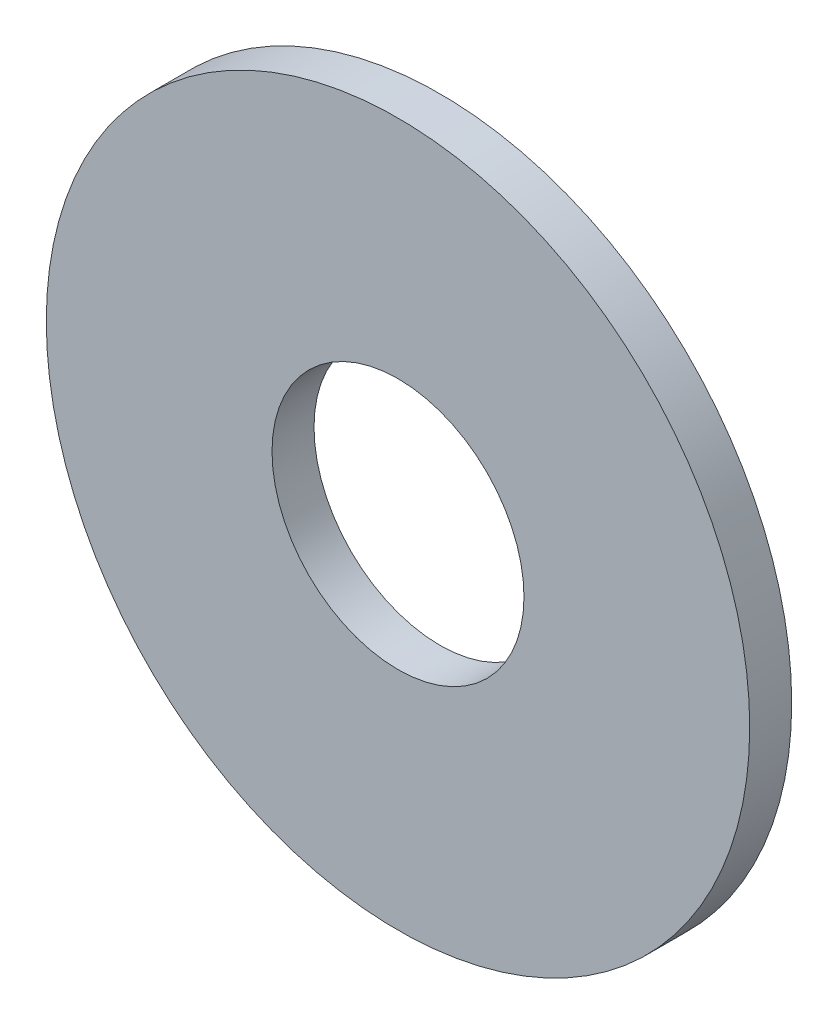
ISO-10303-21;
HEADER;
FILE_DESCRIPTION(('STEP AP214'),'2;1');
FILE_NAME('part.step','',(''),(''),'','','');
FILE_SCHEMA(('AUTOMOTIVE_DESIGN { 1 0 10303 214 1 1 1 1 }'));
ENDSEC;
DATA;
#1=APPLICATION_CONTEXT('core data for automotive mechanical design processes');
#2=APPLICATION_PROTOCOL_DEFINITION('international standard','automotive_design',2000,#1);
#3=PRODUCT_CONTEXT('',#1,'mechanical');
#4=PRODUCT('Part','Part','',(#3));
#5=PRODUCT_RELATED_PRODUCT_CATEGORY('part','',(#4));
#6=PRODUCT_DEFINITION_FORMATION('','',#4);
#7=PRODUCT_DEFINITION_CONTEXT('part definition',#1,'design');
#8=PRODUCT_DEFINITION('design','',#6,#7);
#9=PRODUCT_DEFINITION_SHAPE('','',#8);
#10=(LENGTH_UNIT() NAMED_UNIT(*) SI_UNIT(.MILLI.,.METRE.));
#11=(NAMED_UNIT(*) PLANE_ANGLE_UNIT() SI_UNIT($,.RADIAN.));
#12=(NAMED_UNIT(*) SI_UNIT($,.STERADIAN.) SOLID_ANGLE_UNIT());
#13=UNCERTAINTY_MEASURE_WITH_UNIT(LENGTH_MEASURE(1.E-05),#10,'distance_accuracy_value','');
#14=(GEOMETRIC_REPRESENTATION_CONTEXT(3) GLOBAL_UNCERTAINTY_ASSIGNED_CONTEXT((#13)) GLOBAL_UNIT_ASSIGNED_CONTEXT((#10,
#11,#12)) REPRESENTATION_CONTEXT('',''));
#15=CARTESIAN_POINT('',(0.,0.,0.));
#16=DIRECTION('',(0.,0.,1.));
#17=DIRECTION('',(1.,0.,0.));
#18=AXIS2_PLACEMENT_3D('',#15,#16,#17);
#19=CARTESIAN_POINT('',(0.,0.,2.));
#20=DIRECTION('',(0.,0.,1.));
#21=DIRECTION('',(1.,0.,0.));
#22=AXIS2_PLACEMENT_3D('',#19,#20,#21);
#23=PLANE('',#22);
#24=CARTESIAN_POINT('',(0.,0.,2.));
#25=DIRECTION('',(0.,0.,1.));
#26=DIRECTION('',(1.,0.,0.));
#27=AXIS2_PLACEMENT_3D('',#24,#25,#26);
#28=CIRCLE('',#27,16.75);
#29=CARTESIAN_POINT('',(16.75,0.,2.));
#30=VERTEX_POINT('',#29);
#31=EDGE_CURVE('E10',#30,#30,#28,.T.);
#32=ORIENTED_EDGE('',*,*,#31,.T.);
#33=EDGE_LOOP('',(#32));
#34=FACE_BOUND('',#33,.T.);
#35=CARTESIAN_POINT('',(0.,0.,2.));
#36=DIRECTION('',(0.,0.,1.));
#37=DIRECTION('',(1.,0.,0.));
#38=AXIS2_PLACEMENT_3D('',#35,#36,#37);
#39=CIRCLE('',#38,6.);
#40=CARTESIAN_POINT('',(6.,0.,2.));
#41=VERTEX_POINT('',#40);
#42=EDGE_CURVE('E42',#41,#41,#39,.T.);
#43=ORIENTED_EDGE('',*,*,#42,.F.);
#44=EDGE_LOOP('',(#43));
#45=FACE_BOUND('',#44,.T.);
#46=ADVANCED_FACE('F31',(#34,#45),#23,.T.);
#47=CARTESIAN_POINT('',(0.,0.,0.));
#48=DIRECTION('',(0.,0.,1.));
#49=DIRECTION('',(1.,0.,0.));
#50=AXIS2_PLACEMENT_3D('',#47,#48,#49);
#51=PLANE('',#50);
#52=CARTESIAN_POINT('',(0.,0.,0.));
#53=DIRECTION('',(0.,0.,1.));
#54=DIRECTION('',(1.,0.,0.));
#55=AXIS2_PLACEMENT_3D('',#52,#53,#54);
#56=CIRCLE('',#55,16.75);
#57=CARTESIAN_POINT('',(16.75,0.,0.));
#58=VERTEX_POINT('',#57);
#59=EDGE_CURVE('E38',#58,#58,#56,.T.);
#60=ORIENTED_EDGE('',*,*,#59,.F.);
#61=EDGE_LOOP('',(#60));
#62=FACE_BOUND('',#61,.T.);
#63=CARTESIAN_POINT('',(0.,0.,0.));
#64=DIRECTION('',(0.,0.,1.));
#65=DIRECTION('',(1.,0.,0.));
#66=AXIS2_PLACEMENT_3D('',#63,#64,#65);
#67=CIRCLE('',#66,6.);
#68=CARTESIAN_POINT('',(6.,0.,0.));
#69=VERTEX_POINT('',#68);
#70=EDGE_CURVE('E46',#69,#69,#67,.T.);
#71=ORIENTED_EDGE('',*,*,#70,.T.);
#72=EDGE_LOOP('',(#71));
#73=FACE_BOUND('',#72,.T.);
#74=ADVANCED_FACE('F52',(#62,#73),#51,.F.);
#75=CARTESIAN_POINT('',(0.,0.,2.));
#76=DIRECTION('',(0.,0.,-1.));
#77=DIRECTION('',(-1.,0.,0.));
#78=AXIS2_PLACEMENT_3D('',#75,#76,#77);
#79=CYLINDRICAL_SURFACE('',#78,16.75);
#80=ORIENTED_EDGE('',*,*,#31,.F.);
#81=EDGE_LOOP('',(#80));
#82=FACE_BOUND('',#81,.T.);
#83=ORIENTED_EDGE('',*,*,#59,.T.);
#84=EDGE_LOOP('',(#83));
#85=FACE_BOUND('',#84,.T.);
#86=ADVANCED_FACE('F33',(#82,#85),#79,.T.);
#87=CARTESIAN_POINT('',(0.,0.,2.));
#88=DIRECTION('',(0.,0.,-1.));
#89=DIRECTION('',(-1.,0.,0.));
#90=AXIS2_PLACEMENT_3D('',#87,#88,#89);
#91=CYLINDRICAL_SURFACE('',#90,6.);
#92=ORIENTED_EDGE('',*,*,#42,.T.);
#93=EDGE_LOOP('',(#92));
#94=FACE_BOUND('',#93,.T.);
#95=ORIENTED_EDGE('',*,*,#70,.F.);
#96=EDGE_LOOP('',(#95));
#97=FACE_BOUND('',#96,.T.);
#98=ADVANCED_FACE('F54',(#94,#97),#91,.F.);
#99=CLOSED_SHELL('',(#46,#74,#86,#98));
#100=MANIFOLD_SOLID_BREP('B2',#99);
#101=ADVANCED_BREP_SHAPE_REPRESENTATION('',(#18,#100),#14);
#102=SHAPE_DEFINITION_REPRESENTATION(#9,#101);
ENDSEC;
END-ISO-10303-21;
